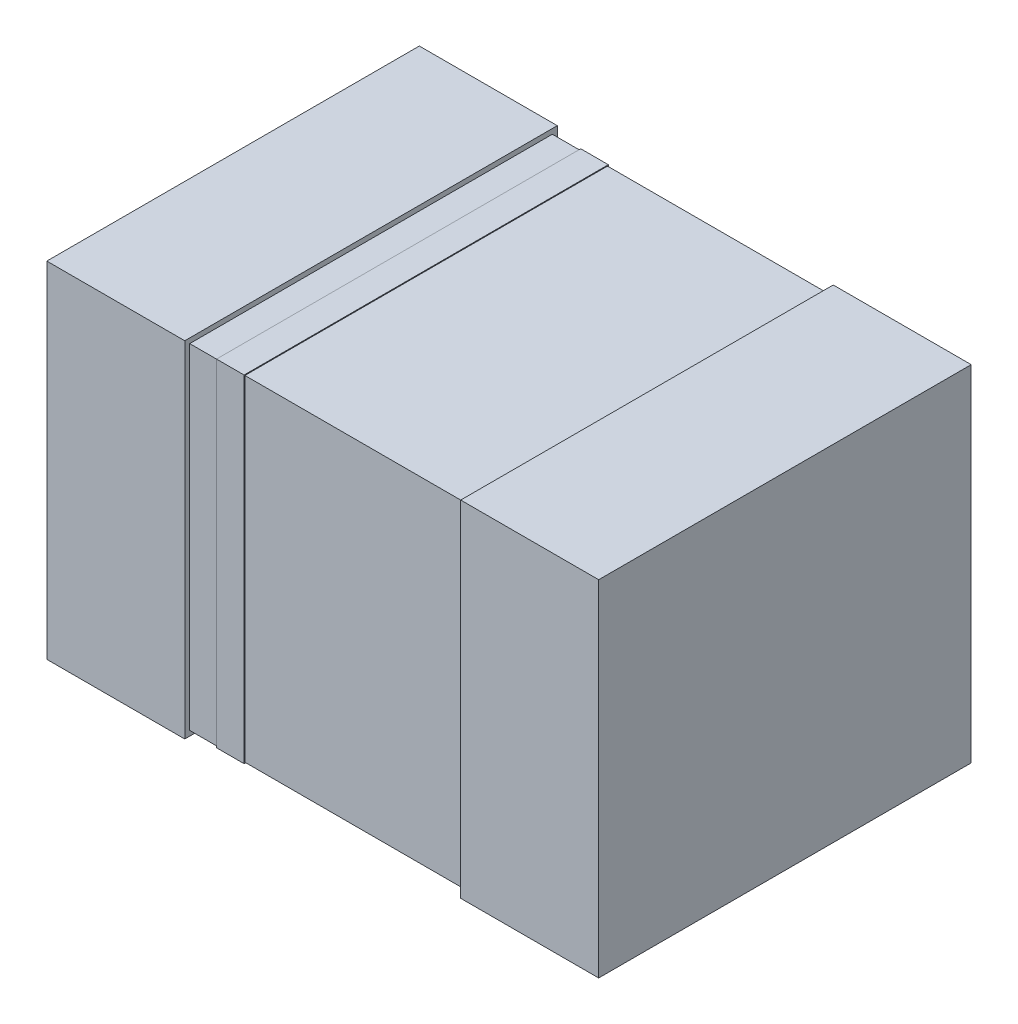
ISO-10303-21;
HEADER;
FILE_DESCRIPTION(('STEP AP214'),'2;1');
FILE_NAME('part.step','',(''),(''),'','','');
FILE_SCHEMA(('AUTOMOTIVE_DESIGN { 1 0 10303 214 1 1 1 1 }'));
ENDSEC;
DATA;
#1=APPLICATION_CONTEXT('core data for automotive mechanical design processes');
#2=APPLICATION_PROTOCOL_DEFINITION('international standard','automotive_design',2000,#1);
#3=PRODUCT_CONTEXT('',#1,'mechanical');
#4=PRODUCT('Part','Part','',(#3));
#5=PRODUCT_RELATED_PRODUCT_CATEGORY('part','',(#4));
#6=PRODUCT_DEFINITION_FORMATION('','',#4);
#7=PRODUCT_DEFINITION_CONTEXT('part definition',#1,'design');
#8=PRODUCT_DEFINITION('design','',#6,#7);
#9=PRODUCT_DEFINITION_SHAPE('','',#8);
#10=(LENGTH_UNIT() NAMED_UNIT(*) SI_UNIT(.MILLI.,.METRE.));
#11=(NAMED_UNIT(*) PLANE_ANGLE_UNIT() SI_UNIT($,.RADIAN.));
#12=(NAMED_UNIT(*) SI_UNIT($,.STERADIAN.) SOLID_ANGLE_UNIT());
#13=UNCERTAINTY_MEASURE_WITH_UNIT(LENGTH_MEASURE(1.E-05),#10,'distance_accuracy_value','');
#14=(GEOMETRIC_REPRESENTATION_CONTEXT(3) GLOBAL_UNCERTAINTY_ASSIGNED_CONTEXT((#13)) GLOBAL_UNIT_ASSIGNED_CONTEXT((#10,
#11,#12)) REPRESENTATION_CONTEXT('',''));
#15=CARTESIAN_POINT('',(0.,0.,0.));
#16=DIRECTION('',(0.,0.,1.));
#17=DIRECTION('',(1.,0.,0.));
#18=AXIS2_PLACEMENT_3D('',#15,#16,#17);
#19=CARTESIAN_POINT('',(-0.5,-0.607,0.018));
#20=DIRECTION('',(0.,-1.,0.));
#21=DIRECTION('',(0.,0.,1.));
#22=AXIS2_PLACEMENT_3D('',#19,#20,#21);
#23=PLANE('',#22);
#24=DIRECTION('',(-1.,0.,0.));
#25=VECTOR('',#24,1.);
#26=CARTESIAN_POINT('',(0.5,-0.607,0.018));
#27=LINE('',#26,#25);
#28=CARTESIAN_POINT('',(0.5,-0.607,0.018));
#29=VERTEX_POINT('',#28);
#30=CARTESIAN_POINT('',(-0.5,-0.607,0.018));
#31=VERTEX_POINT('',#30);
#32=EDGE_CURVE('P0_E11',#29,#31,#27,.T.);
#33=ORIENTED_EDGE('',*,*,#32,.F.);
#34=DIRECTION('',(0.,0.,-1.));
#35=VECTOR('',#34,1.);
#36=CARTESIAN_POINT('',(0.5,-0.607,1.332));
#37=LINE('',#36,#35);
#38=CARTESIAN_POINT('',(0.5,-0.607,1.332));
#39=VERTEX_POINT('',#38);
#40=EDGE_CURVE('P0_E24',#39,#29,#37,.T.);
#41=ORIENTED_EDGE('',*,*,#40,.F.);
#42=DIRECTION('',(1.,0.,0.));
#43=VECTOR('',#42,1.);
#44=CARTESIAN_POINT('',(-0.5,-0.607,1.332));
#45=LINE('',#44,#43);
#46=CARTESIAN_POINT('',(-0.5,-0.607,1.332));
#47=VERTEX_POINT('',#46);
#48=EDGE_CURVE('P0_E88',#47,#39,#45,.T.);
#49=ORIENTED_EDGE('',*,*,#48,.F.);
#50=DIRECTION('',(0.,0.,1.));
#51=VECTOR('',#50,1.);
#52=CARTESIAN_POINT('',(-0.5,-0.607,0.018));
#53=LINE('',#52,#51);
#54=EDGE_CURVE('P0_E77',#31,#47,#53,.T.);
#55=ORIENTED_EDGE('',*,*,#54,.F.);
#56=EDGE_LOOP('',(#33,#41,#49,#55));
#57=FACE_BOUND('',#56,.T.);
#58=ADVANCED_FACE('P0_F17',(#57),#23,.T.);
#59=CARTESIAN_POINT('',(0.5,-0.607,0.018));
#60=DIRECTION('',(1.,0.,0.));
#61=DIRECTION('',(0.,0.,1.));
#62=AXIS2_PLACEMENT_3D('',#59,#60,#61);
#63=PLANE('',#62);
#64=DIRECTION('',(0.,-1.,0.));
#65=VECTOR('',#64,1.);
#66=CARTESIAN_POINT('',(0.5,0.607,0.018));
#67=LINE('',#66,#65);
#68=CARTESIAN_POINT('',(0.5,0.607,0.018));
#69=VERTEX_POINT('',#68);
#70=EDGE_CURVE('P0_E85',#69,#29,#67,.T.);
#71=ORIENTED_EDGE('',*,*,#70,.F.);
#72=DIRECTION('',(0.,0.,-1.));
#73=VECTOR('',#72,1.);
#74=CARTESIAN_POINT('',(0.5,0.607,1.332));
#75=LINE('',#74,#73);
#76=CARTESIAN_POINT('',(0.5,0.607,1.332));
#77=VERTEX_POINT('',#76);
#78=EDGE_CURVE('P0_E83',#77,#69,#75,.T.);
#79=ORIENTED_EDGE('',*,*,#78,.F.);
#80=DIRECTION('',(0.,1.,0.));
#81=VECTOR('',#80,1.);
#82=CARTESIAN_POINT('',(0.5,-0.607,1.332));
#83=LINE('',#82,#81);
#84=EDGE_CURVE('P0_E72',#39,#77,#83,.T.);
#85=ORIENTED_EDGE('',*,*,#84,.F.);
#86=ORIENTED_EDGE('',*,*,#40,.T.);
#87=EDGE_LOOP('',(#71,#79,#85,#86));
#88=FACE_BOUND('',#87,.T.);
#89=ADVANCED_FACE('P0_F90',(#88),#63,.T.);
#90=CARTESIAN_POINT('',(0.5,0.607,0.018));
#91=DIRECTION('',(0.,1.,0.));
#92=DIRECTION('',(0.,0.,1.));
#93=AXIS2_PLACEMENT_3D('',#90,#91,#92);
#94=PLANE('',#93);
#95=DIRECTION('',(1.,0.,0.));
#96=VECTOR('',#95,1.);
#97=CARTESIAN_POINT('',(-0.5,0.607,0.018));
#98=LINE('',#97,#96);
#99=CARTESIAN_POINT('',(-0.5,0.607,0.018));
#100=VERTEX_POINT('',#99);
#101=EDGE_CURVE('P0_E60',#100,#69,#98,.T.);
#102=ORIENTED_EDGE('',*,*,#101,.F.);
#103=DIRECTION('',(0.,0.,-1.));
#104=VECTOR('',#103,1.);
#105=CARTESIAN_POINT('',(-0.5,0.607,1.332));
#106=LINE('',#105,#104);
#107=CARTESIAN_POINT('',(-0.5,0.607,1.332));
#108=VERTEX_POINT('',#107);
#109=EDGE_CURVE('P0_E54',#108,#100,#106,.T.);
#110=ORIENTED_EDGE('',*,*,#109,.F.);
#111=DIRECTION('',(-1.,0.,0.));
#112=VECTOR('',#111,1.);
#113=CARTESIAN_POINT('',(0.5,0.607,1.332));
#114=LINE('',#113,#112);
#115=EDGE_CURVE('P0_E58',#77,#108,#114,.T.);
#116=ORIENTED_EDGE('',*,*,#115,.F.);
#117=ORIENTED_EDGE('',*,*,#78,.T.);
#118=EDGE_LOOP('',(#102,#110,#116,#117));
#119=FACE_BOUND('',#118,.T.);
#120=ADVANCED_FACE('P0_F56',(#119),#94,.T.);
#121=CARTESIAN_POINT('',(-0.5,0.607,0.018));
#122=DIRECTION('',(-1.,0.,0.));
#123=DIRECTION('',(0.,0.,1.));
#124=AXIS2_PLACEMENT_3D('',#121,#122,#123);
#125=PLANE('',#124);
#126=DIRECTION('',(0.,1.,0.));
#127=VECTOR('',#126,1.);
#128=CARTESIAN_POINT('',(-0.5,-0.607,0.018));
#129=LINE('',#128,#127);
#130=EDGE_CURVE('P0_E73',#31,#100,#129,.T.);
#131=ORIENTED_EDGE('',*,*,#130,.F.);
#132=ORIENTED_EDGE('',*,*,#54,.T.);
#133=DIRECTION('',(0.,-1.,0.));
#134=VECTOR('',#133,1.);
#135=CARTESIAN_POINT('',(-0.5,0.607,1.332));
#136=LINE('',#135,#134);
#137=EDGE_CURVE('P0_E70',#108,#47,#136,.T.);
#138=ORIENTED_EDGE('',*,*,#137,.F.);
#139=ORIENTED_EDGE('',*,*,#109,.T.);
#140=EDGE_LOOP('',(#131,#132,#138,#139));
#141=FACE_BOUND('',#140,.T.);
#142=ADVANCED_FACE('P0_F76',(#141),#125,.T.);
#143=CARTESIAN_POINT('',(-0.5,0.607,0.018));
#144=DIRECTION('',(0.,0.,-1.));
#145=DIRECTION('',(0.,1.,0.));
#146=AXIS2_PLACEMENT_3D('',#143,#144,#145);
#147=PLANE('',#146);
#148=ORIENTED_EDGE('',*,*,#101,.T.);
#149=ORIENTED_EDGE('',*,*,#70,.T.);
#150=ORIENTED_EDGE('',*,*,#32,.T.);
#151=ORIENTED_EDGE('',*,*,#130,.T.);
#152=EDGE_LOOP('',(#148,#149,#150,#151));
#153=FACE_BOUND('',#152,.T.);
#154=ADVANCED_FACE('P0_F91',(#153),#147,.T.);
#155=CARTESIAN_POINT('',(-0.5,-0.607,1.332));
#156=DIRECTION('',(0.,0.,1.));
#157=DIRECTION('',(0.,1.,0.));
#158=AXIS2_PLACEMENT_3D('',#155,#156,#157);
#159=PLANE('',#158);
#160=ORIENTED_EDGE('',*,*,#48,.T.);
#161=ORIENTED_EDGE('',*,*,#84,.T.);
#162=ORIENTED_EDGE('',*,*,#115,.T.);
#163=ORIENTED_EDGE('',*,*,#137,.T.);
#164=EDGE_LOOP('',(#160,#161,#162,#163));
#165=FACE_BOUND('',#164,.T.);
#166=ADVANCED_FACE('P0_F69',(#165),#159,.T.);
#167=CLOSED_SHELL('',(#58,#89,#120,#142,#154,#166));
#168=MANIFOLD_SOLID_BREP('P0_B1',#167);
#169=CARTESIAN_POINT('',(0.5,-0.625,0.));
#170=DIRECTION('',(0.,-1.,0.));
#171=DIRECTION('',(0.,0.,1.));
#172=AXIS2_PLACEMENT_3D('',#169,#170,#171);
#173=PLANE('',#172);
#174=DIRECTION('',(-1.,0.,0.));
#175=VECTOR('',#174,1.);
#176=CARTESIAN_POINT('',(1.,-0.625,0.));
#177=LINE('',#176,#175);
#178=CARTESIAN_POINT('',(1.,-0.625,0.));
#179=VERTEX_POINT('',#178);
#180=CARTESIAN_POINT('',(0.5,-0.625,0.));
#181=VERTEX_POINT('',#180);
#182=EDGE_CURVE('P1_E11',#179,#181,#177,.T.);
#183=ORIENTED_EDGE('',*,*,#182,.F.);
#184=DIRECTION('',(0.,0.,-1.));
#185=VECTOR('',#184,1.);
#186=CARTESIAN_POINT('',(1.,-0.625,1.35));
#187=LINE('',#186,#185);
#188=CARTESIAN_POINT('',(1.,-0.625,1.35));
#189=VERTEX_POINT('',#188);
#190=EDGE_CURVE('P1_E24',#189,#179,#187,.T.);
#191=ORIENTED_EDGE('',*,*,#190,.F.);
#192=DIRECTION('',(1.,0.,0.));
#193=VECTOR('',#192,1.);
#194=CARTESIAN_POINT('',(0.5,-0.625,1.35));
#195=LINE('',#194,#193);
#196=CARTESIAN_POINT('',(0.5,-0.625,1.35));
#197=VERTEX_POINT('',#196);
#198=EDGE_CURVE('P1_E88',#197,#189,#195,.T.);
#199=ORIENTED_EDGE('',*,*,#198,.F.);
#200=DIRECTION('',(0.,0.,1.));
#201=VECTOR('',#200,1.);
#202=CARTESIAN_POINT('',(0.5,-0.625,0.));
#203=LINE('',#202,#201);
#204=EDGE_CURVE('P1_E77',#181,#197,#203,.T.);
#205=ORIENTED_EDGE('',*,*,#204,.F.);
#206=EDGE_LOOP('',(#183,#191,#199,#205));
#207=FACE_BOUND('',#206,.T.);
#208=ADVANCED_FACE('P1_F17',(#207),#173,.T.);
#209=CARTESIAN_POINT('',(1.,-0.625,0.));
#210=DIRECTION('',(1.,0.,0.));
#211=DIRECTION('',(0.,0.,1.));
#212=AXIS2_PLACEMENT_3D('',#209,#210,#211);
#213=PLANE('',#212);
#214=DIRECTION('',(0.,-1.,0.));
#215=VECTOR('',#214,1.);
#216=CARTESIAN_POINT('',(1.,0.625,0.));
#217=LINE('',#216,#215);
#218=CARTESIAN_POINT('',(1.,0.625,0.));
#219=VERTEX_POINT('',#218);
#220=EDGE_CURVE('P1_E85',#219,#179,#217,.T.);
#221=ORIENTED_EDGE('',*,*,#220,.F.);
#222=DIRECTION('',(0.,0.,-1.));
#223=VECTOR('',#222,1.);
#224=CARTESIAN_POINT('',(1.,0.625,1.35));
#225=LINE('',#224,#223);
#226=CARTESIAN_POINT('',(1.,0.625,1.35));
#227=VERTEX_POINT('',#226);
#228=EDGE_CURVE('P1_E83',#227,#219,#225,.T.);
#229=ORIENTED_EDGE('',*,*,#228,.F.);
#230=DIRECTION('',(0.,1.,0.));
#231=VECTOR('',#230,1.);
#232=CARTESIAN_POINT('',(1.,-0.625,1.35));
#233=LINE('',#232,#231);
#234=EDGE_CURVE('P1_E72',#189,#227,#233,.T.);
#235=ORIENTED_EDGE('',*,*,#234,.F.);
#236=ORIENTED_EDGE('',*,*,#190,.T.);
#237=EDGE_LOOP('',(#221,#229,#235,#236));
#238=FACE_BOUND('',#237,.T.);
#239=ADVANCED_FACE('P1_F90',(#238),#213,.T.);
#240=CARTESIAN_POINT('',(1.,0.625,0.));
#241=DIRECTION('',(0.,1.,0.));
#242=DIRECTION('',(0.,0.,1.));
#243=AXIS2_PLACEMENT_3D('',#240,#241,#242);
#244=PLANE('',#243);
#245=DIRECTION('',(1.,0.,0.));
#246=VECTOR('',#245,1.);
#247=CARTESIAN_POINT('',(0.5,0.625,0.));
#248=LINE('',#247,#246);
#249=CARTESIAN_POINT('',(0.5,0.625,0.));
#250=VERTEX_POINT('',#249);
#251=EDGE_CURVE('P1_E60',#250,#219,#248,.T.);
#252=ORIENTED_EDGE('',*,*,#251,.F.);
#253=DIRECTION('',(0.,0.,-1.));
#254=VECTOR('',#253,1.);
#255=CARTESIAN_POINT('',(0.5,0.625,1.35));
#256=LINE('',#255,#254);
#257=CARTESIAN_POINT('',(0.5,0.625,1.35));
#258=VERTEX_POINT('',#257);
#259=EDGE_CURVE('P1_E54',#258,#250,#256,.T.);
#260=ORIENTED_EDGE('',*,*,#259,.F.);
#261=DIRECTION('',(-1.,0.,0.));
#262=VECTOR('',#261,1.);
#263=CARTESIAN_POINT('',(1.,0.625,1.35));
#264=LINE('',#263,#262);
#265=EDGE_CURVE('P1_E58',#227,#258,#264,.T.);
#266=ORIENTED_EDGE('',*,*,#265,.F.);
#267=ORIENTED_EDGE('',*,*,#228,.T.);
#268=EDGE_LOOP('',(#252,#260,#266,#267));
#269=FACE_BOUND('',#268,.T.);
#270=ADVANCED_FACE('P1_F56',(#269),#244,.T.);
#271=CARTESIAN_POINT('',(0.5,0.625,0.));
#272=DIRECTION('',(-1.,0.,0.));
#273=DIRECTION('',(0.,0.,1.));
#274=AXIS2_PLACEMENT_3D('',#271,#272,#273);
#275=PLANE('',#274);
#276=DIRECTION('',(0.,1.,0.));
#277=VECTOR('',#276,1.);
#278=CARTESIAN_POINT('',(0.5,-0.625,0.));
#279=LINE('',#278,#277);
#280=EDGE_CURVE('P1_E73',#181,#250,#279,.T.);
#281=ORIENTED_EDGE('',*,*,#280,.F.);
#282=ORIENTED_EDGE('',*,*,#204,.T.);
#283=DIRECTION('',(0.,-1.,0.));
#284=VECTOR('',#283,1.);
#285=CARTESIAN_POINT('',(0.5,0.625,1.35));
#286=LINE('',#285,#284);
#287=EDGE_CURVE('P1_E70',#258,#197,#286,.T.);
#288=ORIENTED_EDGE('',*,*,#287,.F.);
#289=ORIENTED_EDGE('',*,*,#259,.T.);
#290=EDGE_LOOP('',(#281,#282,#288,#289));
#291=FACE_BOUND('',#290,.T.);
#292=ADVANCED_FACE('P1_F76',(#291),#275,.T.);
#293=CARTESIAN_POINT('',(0.5,0.625,0.));
#294=DIRECTION('',(0.,0.,-1.));
#295=DIRECTION('',(0.,1.,0.));
#296=AXIS2_PLACEMENT_3D('',#293,#294,#295);
#297=PLANE('',#296);
#298=ORIENTED_EDGE('',*,*,#251,.T.);
#299=ORIENTED_EDGE('',*,*,#220,.T.);
#300=ORIENTED_EDGE('',*,*,#182,.T.);
#301=ORIENTED_EDGE('',*,*,#280,.T.);
#302=EDGE_LOOP('',(#298,#299,#300,#301));
#303=FACE_BOUND('',#302,.T.);
#304=ADVANCED_FACE('P1_F91',(#303),#297,.T.);
#305=CARTESIAN_POINT('',(0.5,-0.625,1.35));
#306=DIRECTION('',(0.,0.,1.));
#307=DIRECTION('',(0.,1.,0.));
#308=AXIS2_PLACEMENT_3D('',#305,#306,#307);
#309=PLANE('',#308);
#310=ORIENTED_EDGE('',*,*,#198,.T.);
#311=ORIENTED_EDGE('',*,*,#234,.T.);
#312=ORIENTED_EDGE('',*,*,#265,.T.);
#313=ORIENTED_EDGE('',*,*,#287,.T.);
#314=EDGE_LOOP('',(#310,#311,#312,#313));
#315=FACE_BOUND('',#314,.T.);
#316=ADVANCED_FACE('P1_F69',(#315),#309,.T.);
#317=CLOSED_SHELL('',(#208,#239,#270,#292,#304,#316));
#318=MANIFOLD_SOLID_BREP('P1_B1',#317);
#319=CARTESIAN_POINT('',(-1.,-0.625,0.));
#320=DIRECTION('',(0.,-1.,0.));
#321=DIRECTION('',(0.,0.,1.));
#322=AXIS2_PLACEMENT_3D('',#319,#320,#321);
#323=PLANE('',#322);
#324=DIRECTION('',(-1.,0.,0.));
#325=VECTOR('',#324,1.);
#326=CARTESIAN_POINT('',(-0.5,-0.625,0.));
#327=LINE('',#326,#325);
#328=CARTESIAN_POINT('',(-0.5,-0.625,0.));
#329=VERTEX_POINT('',#328);
#330=CARTESIAN_POINT('',(-1.,-0.625,0.));
#331=VERTEX_POINT('',#330);
#332=EDGE_CURVE('P2_E11',#329,#331,#327,.T.);
#333=ORIENTED_EDGE('',*,*,#332,.F.);
#334=DIRECTION('',(0.,0.,-1.));
#335=VECTOR('',#334,1.);
#336=CARTESIAN_POINT('',(-0.5,-0.625,1.35));
#337=LINE('',#336,#335);
#338=CARTESIAN_POINT('',(-0.5,-0.625,1.35));
#339=VERTEX_POINT('',#338);
#340=EDGE_CURVE('P2_E24',#339,#329,#337,.T.);
#341=ORIENTED_EDGE('',*,*,#340,.F.);
#342=DIRECTION('',(1.,0.,0.));
#343=VECTOR('',#342,1.);
#344=CARTESIAN_POINT('',(-1.,-0.625,1.35));
#345=LINE('',#344,#343);
#346=CARTESIAN_POINT('',(-1.,-0.625,1.35));
#347=VERTEX_POINT('',#346);
#348=EDGE_CURVE('P2_E88',#347,#339,#345,.T.);
#349=ORIENTED_EDGE('',*,*,#348,.F.);
#350=DIRECTION('',(0.,0.,1.));
#351=VECTOR('',#350,1.);
#352=CARTESIAN_POINT('',(-1.,-0.625,0.));
#353=LINE('',#352,#351);
#354=EDGE_CURVE('P2_E77',#331,#347,#353,.T.);
#355=ORIENTED_EDGE('',*,*,#354,.F.);
#356=EDGE_LOOP('',(#333,#341,#349,#355));
#357=FACE_BOUND('',#356,.T.);
#358=ADVANCED_FACE('P2_F17',(#357),#323,.T.);
#359=CARTESIAN_POINT('',(-0.5,-0.625,0.));
#360=DIRECTION('',(1.,0.,0.));
#361=DIRECTION('',(0.,0.,1.));
#362=AXIS2_PLACEMENT_3D('',#359,#360,#361);
#363=PLANE('',#362);
#364=DIRECTION('',(0.,-1.,0.));
#365=VECTOR('',#364,1.);
#366=CARTESIAN_POINT('',(-0.5,0.625,0.));
#367=LINE('',#366,#365);
#368=CARTESIAN_POINT('',(-0.5,0.625,0.));
#369=VERTEX_POINT('',#368);
#370=EDGE_CURVE('P2_E85',#369,#329,#367,.T.);
#371=ORIENTED_EDGE('',*,*,#370,.F.);
#372=DIRECTION('',(0.,0.,-1.));
#373=VECTOR('',#372,1.);
#374=CARTESIAN_POINT('',(-0.5,0.625,1.35));
#375=LINE('',#374,#373);
#376=CARTESIAN_POINT('',(-0.5,0.625,1.35));
#377=VERTEX_POINT('',#376);
#378=EDGE_CURVE('P2_E83',#377,#369,#375,.T.);
#379=ORIENTED_EDGE('',*,*,#378,.F.);
#380=DIRECTION('',(0.,1.,0.));
#381=VECTOR('',#380,1.);
#382=CARTESIAN_POINT('',(-0.5,-0.625,1.35));
#383=LINE('',#382,#381);
#384=EDGE_CURVE('P2_E72',#339,#377,#383,.T.);
#385=ORIENTED_EDGE('',*,*,#384,.F.);
#386=ORIENTED_EDGE('',*,*,#340,.T.);
#387=EDGE_LOOP('',(#371,#379,#385,#386));
#388=FACE_BOUND('',#387,.T.);
#389=ADVANCED_FACE('P2_F90',(#388),#363,.T.);
#390=CARTESIAN_POINT('',(-0.5,0.625,0.));
#391=DIRECTION('',(0.,1.,0.));
#392=DIRECTION('',(0.,0.,1.));
#393=AXIS2_PLACEMENT_3D('',#390,#391,#392);
#394=PLANE('',#393);
#395=DIRECTION('',(1.,0.,0.));
#396=VECTOR('',#395,1.);
#397=CARTESIAN_POINT('',(-1.,0.625,0.));
#398=LINE('',#397,#396);
#399=CARTESIAN_POINT('',(-1.,0.625,0.));
#400=VERTEX_POINT('',#399);
#401=EDGE_CURVE('P2_E60',#400,#369,#398,.T.);
#402=ORIENTED_EDGE('',*,*,#401,.F.);
#403=DIRECTION('',(0.,0.,-1.));
#404=VECTOR('',#403,1.);
#405=CARTESIAN_POINT('',(-1.,0.625,1.35));
#406=LINE('',#405,#404);
#407=CARTESIAN_POINT('',(-1.,0.625,1.35));
#408=VERTEX_POINT('',#407);
#409=EDGE_CURVE('P2_E54',#408,#400,#406,.T.);
#410=ORIENTED_EDGE('',*,*,#409,.F.);
#411=DIRECTION('',(-1.,0.,0.));
#412=VECTOR('',#411,1.);
#413=CARTESIAN_POINT('',(-0.5,0.625,1.35));
#414=LINE('',#413,#412);
#415=EDGE_CURVE('P2_E58',#377,#408,#414,.T.);
#416=ORIENTED_EDGE('',*,*,#415,.F.);
#417=ORIENTED_EDGE('',*,*,#378,.T.);
#418=EDGE_LOOP('',(#402,#410,#416,#417));
#419=FACE_BOUND('',#418,.T.);
#420=ADVANCED_FACE('P2_F56',(#419),#394,.T.);
#421=CARTESIAN_POINT('',(-1.,0.625,0.));
#422=DIRECTION('',(-1.,0.,0.));
#423=DIRECTION('',(0.,0.,1.));
#424=AXIS2_PLACEMENT_3D('',#421,#422,#423);
#425=PLANE('',#424);
#426=DIRECTION('',(0.,1.,0.));
#427=VECTOR('',#426,1.);
#428=CARTESIAN_POINT('',(-1.,-0.625,0.));
#429=LINE('',#428,#427);
#430=EDGE_CURVE('P2_E73',#331,#400,#429,.T.);
#431=ORIENTED_EDGE('',*,*,#430,.F.);
#432=ORIENTED_EDGE('',*,*,#354,.T.);
#433=DIRECTION('',(0.,-1.,0.));
#434=VECTOR('',#433,1.);
#435=CARTESIAN_POINT('',(-1.,0.625,1.35));
#436=LINE('',#435,#434);
#437=EDGE_CURVE('P2_E70',#408,#347,#436,.T.);
#438=ORIENTED_EDGE('',*,*,#437,.F.);
#439=ORIENTED_EDGE('',*,*,#409,.T.);
#440=EDGE_LOOP('',(#431,#432,#438,#439));
#441=FACE_BOUND('',#440,.T.);
#442=ADVANCED_FACE('P2_F76',(#441),#425,.T.);
#443=CARTESIAN_POINT('',(-1.,0.625,0.));
#444=DIRECTION('',(0.,0.,-1.));
#445=DIRECTION('',(0.,1.,0.));
#446=AXIS2_PLACEMENT_3D('',#443,#444,#445);
#447=PLANE('',#446);
#448=ORIENTED_EDGE('',*,*,#401,.T.);
#449=ORIENTED_EDGE('',*,*,#370,.T.);
#450=ORIENTED_EDGE('',*,*,#332,.T.);
#451=ORIENTED_EDGE('',*,*,#430,.T.);
#452=EDGE_LOOP('',(#448,#449,#450,#451));
#453=FACE_BOUND('',#452,.T.);
#454=ADVANCED_FACE('P2_F91',(#453),#447,.T.);
#455=CARTESIAN_POINT('',(-1.,-0.625,1.35));
#456=DIRECTION('',(0.,0.,1.));
#457=DIRECTION('',(0.,1.,0.));
#458=AXIS2_PLACEMENT_3D('',#455,#456,#457);
#459=PLANE('',#458);
#460=ORIENTED_EDGE('',*,*,#348,.T.);
#461=ORIENTED_EDGE('',*,*,#384,.T.);
#462=ORIENTED_EDGE('',*,*,#415,.T.);
#463=ORIENTED_EDGE('',*,*,#437,.T.);
#464=EDGE_LOOP('',(#460,#461,#462,#463));
#465=FACE_BOUND('',#464,.T.);
#466=ADVANCED_FACE('P2_F69',(#465),#459,.T.);
#467=CLOSED_SHELL('',(#358,#389,#420,#442,#454,#466));
#468=MANIFOLD_SOLID_BREP('P2_B1',#467);
#469=CARTESIAN_POINT('',(-0.4,0.61,0.015));
#470=DIRECTION('',(0.,0.,-1.));
#471=DIRECTION('',(0.,1.,0.));
#472=AXIS2_PLACEMENT_3D('',#469,#470,#471);
#473=PLANE('',#472);
#474=DIRECTION('',(-1.,0.,0.));
#475=VECTOR('',#474,1.);
#476=CARTESIAN_POINT('',(-0.3,0.61,0.015));
#477=LINE('',#476,#475);
#478=CARTESIAN_POINT('',(-0.3,0.61,0.015));
#479=VERTEX_POINT('',#478);
#480=CARTESIAN_POINT('',(-0.4,0.61,0.015));
#481=VERTEX_POINT('',#480);
#482=EDGE_CURVE('P3_E10',#479,#481,#477,.T.);
#483=ORIENTED_EDGE('',*,*,#482,.F.);
#484=DIRECTION('',(0.,1.,0.));
#485=VECTOR('',#484,1.);
#486=CARTESIAN_POINT('',(-0.3,-0.61,0.015));
#487=LINE('',#486,#485);
#488=CARTESIAN_POINT('',(-0.3,-0.61,0.015));
#489=VERTEX_POINT('',#488);
#490=EDGE_CURVE('P3_E23',#489,#479,#487,.T.);
#491=ORIENTED_EDGE('',*,*,#490,.F.);
#492=DIRECTION('',(1.,0.,0.));
#493=VECTOR('',#492,1.);
#494=CARTESIAN_POINT('',(-0.4,-0.61,0.015));
#495=LINE('',#494,#493);
#496=CARTESIAN_POINT('',(-0.4,-0.61,0.015));
#497=VERTEX_POINT('',#496);
#498=EDGE_CURVE('P3_E160',#497,#489,#495,.T.);
#499=ORIENTED_EDGE('',*,*,#498,.F.);
#500=DIRECTION('',(0.,-1.,0.));
#501=VECTOR('',#500,1.);
#502=CARTESIAN_POINT('',(-0.4,0.61,0.015));
#503=LINE('',#502,#501);
#504=EDGE_CURVE('P3_E157',#481,#497,#503,.T.);
#505=ORIENTED_EDGE('',*,*,#504,.F.);
#506=EDGE_LOOP('',(#483,#491,#499,#505));
#507=FACE_BOUND('',#506,.T.);
#508=ADVANCED_FACE('P3_F16',(#507),#473,.T.);
#509=CARTESIAN_POINT('',(-0.4,-0.61,0.015));
#510=DIRECTION('',(0.,-1.,0.));
#511=DIRECTION('',(0.,0.,1.));
#512=AXIS2_PLACEMENT_3D('',#509,#510,#511);
#513=PLANE('',#512);
#514=ORIENTED_EDGE('',*,*,#498,.T.);
#515=DIRECTION('',(0.,0.,-1.));
#516=VECTOR('',#515,1.);
#517=CARTESIAN_POINT('',(-0.3,-0.61,1.335));
#518=LINE('',#517,#516);
#519=CARTESIAN_POINT('',(-0.3,-0.61,1.335));
#520=VERTEX_POINT('',#519);
#521=EDGE_CURVE('P3_E154',#520,#489,#518,.T.);
#522=ORIENTED_EDGE('',*,*,#521,.F.);
#523=DIRECTION('',(1.,0.,0.));
#524=VECTOR('',#523,1.);
#525=CARTESIAN_POINT('',(-0.4,-0.61,1.335));
#526=LINE('',#525,#524);
#527=CARTESIAN_POINT('',(-0.4,-0.61,1.335));
#528=VERTEX_POINT('',#527);
#529=EDGE_CURVE('P3_E151',#528,#520,#526,.T.);
#530=ORIENTED_EDGE('',*,*,#529,.F.);
#531=DIRECTION('',(0.,0.,1.));
#532=VECTOR('',#531,1.);
#533=CARTESIAN_POINT('',(-0.4,-0.61,0.015));
#534=LINE('',#533,#532);
#535=EDGE_CURVE('P3_E148',#497,#528,#534,.T.);
#536=ORIENTED_EDGE('',*,*,#535,.F.);
#537=EDGE_LOOP('',(#514,#522,#530,#536));
#538=FACE_BOUND('',#537,.T.);
#539=ADVANCED_FACE('P3_F172',(#538),#513,.T.);
#540=CARTESIAN_POINT('',(-0.3,0.61,0.015));
#541=DIRECTION('',(0.,1.,0.));
#542=DIRECTION('',(0.,0.,1.));
#543=AXIS2_PLACEMENT_3D('',#540,#541,#542);
#544=PLANE('',#543);
#545=ORIENTED_EDGE('',*,*,#482,.T.);
#546=DIRECTION('',(0.,0.,-1.));
#547=VECTOR('',#546,1.);
#548=CARTESIAN_POINT('',(-0.4,0.61,1.335));
#549=LINE('',#548,#547);
#550=CARTESIAN_POINT('',(-0.4,0.61,1.335));
#551=VERTEX_POINT('',#550);
#552=EDGE_CURVE('P3_E145',#551,#481,#549,.T.);
#553=ORIENTED_EDGE('',*,*,#552,.F.);
#554=DIRECTION('',(-1.,0.,0.));
#555=VECTOR('',#554,1.);
#556=CARTESIAN_POINT('',(-0.3,0.61,1.335));
#557=LINE('',#556,#555);
#558=CARTESIAN_POINT('',(-0.3,0.61,1.335));
#559=VERTEX_POINT('',#558);
#560=EDGE_CURVE('P3_E142',#559,#551,#557,.T.);
#561=ORIENTED_EDGE('',*,*,#560,.F.);
#562=DIRECTION('',(0.,0.,1.));
#563=VECTOR('',#562,1.);
#564=CARTESIAN_POINT('',(-0.3,0.61,0.015));
#565=LINE('',#564,#563);
#566=EDGE_CURVE('P3_E139',#479,#559,#565,.T.);
#567=ORIENTED_EDGE('',*,*,#566,.F.);
#568=EDGE_LOOP('',(#545,#553,#561,#567));
#569=FACE_BOUND('',#568,.T.);
#570=ADVANCED_FACE('P3_F166',(#569),#544,.T.);
#571=CARTESIAN_POINT('',(-0.4,-0.61,1.335));
#572=DIRECTION('',(0.,0.,1.));
#573=DIRECTION('',(0.,1.,0.));
#574=AXIS2_PLACEMENT_3D('',#571,#572,#573);
#575=PLANE('',#574);
#576=ORIENTED_EDGE('',*,*,#529,.T.);
#577=DIRECTION('',(0.,-1.,0.));
#578=VECTOR('',#577,1.);
#579=CARTESIAN_POINT('',(-0.3,0.61,1.335));
#580=LINE('',#579,#578);
#581=EDGE_CURVE('P3_E136',#559,#520,#580,.T.);
#582=ORIENTED_EDGE('',*,*,#581,.F.);
#583=ORIENTED_EDGE('',*,*,#560,.T.);
#584=DIRECTION('',(0.,1.,0.));
#585=VECTOR('',#584,1.);
#586=CARTESIAN_POINT('',(-0.4,-0.61,1.335));
#587=LINE('',#586,#585);
#588=EDGE_CURVE('P3_E134',#528,#551,#587,.T.);
#589=ORIENTED_EDGE('',*,*,#588,.F.);
#590=EDGE_LOOP('',(#576,#582,#583,#589));
#591=FACE_BOUND('',#590,.T.);
#592=ADVANCED_FACE('P3_F169',(#591),#575,.T.);
#593=CARTESIAN_POINT('',(-0.3,-0.61,0.015));
#594=DIRECTION('',(1.,0.,0.));
#595=DIRECTION('',(0.,0.,1.));
#596=AXIS2_PLACEMENT_3D('',#593,#594,#595);
#597=PLANE('',#596);
#598=ORIENTED_EDGE('',*,*,#490,.T.);
#599=ORIENTED_EDGE('',*,*,#566,.T.);
#600=DIRECTION('',(0.,0.707106781186548,0.707106781186548));
#601=VECTOR('',#600,1.);
#602=CARTESIAN_POINT('',(-0.3,0.607,1.332));
#603=LINE('',#602,#601);
#604=CARTESIAN_POINT('',(-0.3,0.607,1.332));
#605=VERTEX_POINT('',#604);
#606=EDGE_CURVE('P3_E131',#605,#559,#603,.T.);
#607=ORIENTED_EDGE('',*,*,#606,.F.);
#608=DIRECTION('',(0.,0.,1.));
#609=VECTOR('',#608,1.);
#610=CARTESIAN_POINT('',(-0.3,0.607,0.018));
#611=LINE('',#610,#609);
#612=CARTESIAN_POINT('',(-0.3,0.607,0.018));
#613=VERTEX_POINT('',#612);
#614=EDGE_CURVE('P3_E128',#613,#605,#611,.T.);
#615=ORIENTED_EDGE('',*,*,#614,.F.);
#616=DIRECTION('',(0.,1.,0.));
#617=VECTOR('',#616,1.);
#618=CARTESIAN_POINT('',(-0.3,-0.607,0.018));
#619=LINE('',#618,#617);
#620=CARTESIAN_POINT('',(-0.3,-0.607,0.018));
#621=VERTEX_POINT('',#620);
#622=EDGE_CURVE('P3_E126',#621,#613,#619,.T.);
#623=ORIENTED_EDGE('',*,*,#622,.F.);
#624=DIRECTION('',(0.,0.707106781186548,0.707106781186548));
#625=VECTOR('',#624,1.);
#626=CARTESIAN_POINT('',(-0.3,-0.61,0.015));
#627=LINE('',#626,#625);
#628=EDGE_CURVE('P3_E123',#489,#621,#627,.T.);
#629=ORIENTED_EDGE('',*,*,#628,.F.);
#630=EDGE_LOOP('',(#598,#599,#607,#615,#623,#629));
#631=FACE_BOUND('',#630,.T.);
#632=ADVANCED_FACE('P3_F163',(#631),#597,.T.);
#633=CARTESIAN_POINT('',(-0.3,-0.61,0.015));
#634=DIRECTION('',(1.,0.,0.));
#635=DIRECTION('',(0.,0.,1.));
#636=AXIS2_PLACEMENT_3D('',#633,#634,#635);
#637=PLANE('',#636);
#638=ORIENTED_EDGE('',*,*,#628,.T.);
#639=DIRECTION('',(0.,0.,-1.));
#640=VECTOR('',#639,1.);
#641=CARTESIAN_POINT('',(-0.3,-0.607,1.332));
#642=LINE('',#641,#640);
#643=CARTESIAN_POINT('',(-0.3,-0.607,1.332));
#644=VERTEX_POINT('',#643);
#645=EDGE_CURVE('P3_E121',#644,#621,#642,.T.);
#646=ORIENTED_EDGE('',*,*,#645,.F.);
#647=DIRECTION('',(0.,-1.,0.));
#648=VECTOR('',#647,1.);
#649=CARTESIAN_POINT('',(-0.3,0.607,1.332));
#650=LINE('',#649,#648);
#651=EDGE_CURVE('P3_E103',#605,#644,#650,.T.);
#652=ORIENTED_EDGE('',*,*,#651,.F.);
#653=ORIENTED_EDGE('',*,*,#606,.T.);
#654=ORIENTED_EDGE('',*,*,#581,.T.);
#655=ORIENTED_EDGE('',*,*,#521,.T.);
#656=EDGE_LOOP('',(#638,#646,#652,#653,#654,#655));
#657=FACE_BOUND('',#656,.T.);
#658=ADVANCED_FACE('P3_F174',(#657),#637,.T.);
#659=CARTESIAN_POINT('',(-0.4,0.61,0.015));
#660=DIRECTION('',(-1.,0.,0.));
#661=DIRECTION('',(0.,0.,1.));
#662=AXIS2_PLACEMENT_3D('',#659,#660,#661);
#663=PLANE('',#662);
#664=ORIENTED_EDGE('',*,*,#504,.T.);
#665=DIRECTION('',(0.,-0.707106781186548,-0.707106781186548));
#666=VECTOR('',#665,1.);
#667=CARTESIAN_POINT('',(-0.4,-0.607,0.018));
#668=LINE('',#667,#666);
#669=CARTESIAN_POINT('',(-0.4,-0.607,0.018));
#670=VERTEX_POINT('',#669);
#671=EDGE_CURVE('P3_E118',#670,#497,#668,.T.);
#672=ORIENTED_EDGE('',*,*,#671,.F.);
#673=DIRECTION('',(0.,-1.,0.));
#674=VECTOR('',#673,1.);
#675=CARTESIAN_POINT('',(-0.4,0.607,0.018));
#676=LINE('',#675,#674);
#677=CARTESIAN_POINT('',(-0.4,0.607,0.018));
#678=VERTEX_POINT('',#677);
#679=EDGE_CURVE('P3_E115',#678,#670,#676,.T.);
#680=ORIENTED_EDGE('',*,*,#679,.F.);
#681=DIRECTION('',(0.,0.,-1.));
#682=VECTOR('',#681,1.);
#683=CARTESIAN_POINT('',(-0.4,0.607,1.332));
#684=LINE('',#683,#682);
#685=CARTESIAN_POINT('',(-0.4,0.607,1.332));
#686=VERTEX_POINT('',#685);
#687=EDGE_CURVE('P3_E112',#686,#678,#684,.T.);
#688=ORIENTED_EDGE('',*,*,#687,.F.);
#689=DIRECTION('',(0.,-0.707106781186548,-0.707106781186548));
#690=VECTOR('',#689,1.);
#691=CARTESIAN_POINT('',(-0.4,0.61,1.335));
#692=LINE('',#691,#690);
#693=EDGE_CURVE('P3_E86',#551,#686,#692,.T.);
#694=ORIENTED_EDGE('',*,*,#693,.F.);
#695=ORIENTED_EDGE('',*,*,#552,.T.);
#696=EDGE_LOOP('',(#664,#672,#680,#688,#694,#695));
#697=FACE_BOUND('',#696,.T.);
#698=ADVANCED_FACE('P3_F182',(#697),#663,.T.);
#699=CARTESIAN_POINT('',(-0.4,-0.607,0.018));
#700=DIRECTION('',(-1.,0.,0.));
#701=DIRECTION('',(0.,0.,1.));
#702=AXIS2_PLACEMENT_3D('',#699,#700,#701);
#703=PLANE('',#702);
#704=ORIENTED_EDGE('',*,*,#671,.T.);
#705=ORIENTED_EDGE('',*,*,#535,.T.);
#706=ORIENTED_EDGE('',*,*,#588,.T.);
#707=ORIENTED_EDGE('',*,*,#693,.T.);
#708=DIRECTION('',(0.,1.,0.));
#709=VECTOR('',#708,1.);
#710=CARTESIAN_POINT('',(-0.4,-0.607,1.332));
#711=LINE('',#710,#709);
#712=CARTESIAN_POINT('',(-0.4,-0.607,1.332));
#713=VERTEX_POINT('',#712);
#714=EDGE_CURVE('P3_E79',#713,#686,#711,.T.);
#715=ORIENTED_EDGE('',*,*,#714,.F.);
#716=DIRECTION('',(0.,0.,1.));
#717=VECTOR('',#716,1.);
#718=CARTESIAN_POINT('',(-0.4,-0.607,0.018));
#719=LINE('',#718,#717);
#720=EDGE_CURVE('P3_E83',#670,#713,#719,.T.);
#721=ORIENTED_EDGE('',*,*,#720,.F.);
#722=EDGE_LOOP('',(#704,#705,#706,#707,#715,#721));
#723=FACE_BOUND('',#722,.T.);
#724=ADVANCED_FACE('P3_F82',(#723),#703,.T.);
#725=CARTESIAN_POINT('',(-0.4,0.607,0.018));
#726=DIRECTION('',(0.,-1.,0.));
#727=DIRECTION('',(0.,0.,1.));
#728=AXIS2_PLACEMENT_3D('',#725,#726,#727);
#729=PLANE('',#728);
#730=DIRECTION('',(-1.,0.,0.));
#731=VECTOR('',#730,1.);
#732=CARTESIAN_POINT('',(-0.3,0.607,0.018));
#733=LINE('',#732,#731);
#734=EDGE_CURVE('P3_E99',#613,#678,#733,.T.);
#735=ORIENTED_EDGE('',*,*,#734,.F.);
#736=ORIENTED_EDGE('',*,*,#614,.T.);
#737=DIRECTION('',(1.,0.,0.));
#738=VECTOR('',#737,1.);
#739=CARTESIAN_POINT('',(-0.4,0.607,1.332));
#740=LINE('',#739,#738);
#741=EDGE_CURVE('P3_E105',#686,#605,#740,.T.);
#742=ORIENTED_EDGE('',*,*,#741,.F.);
#743=ORIENTED_EDGE('',*,*,#687,.T.);
#744=EDGE_LOOP('',(#735,#736,#742,#743));
#745=FACE_BOUND('',#744,.T.);
#746=ADVANCED_FACE('P3_F178',(#745),#729,.T.);
#747=CARTESIAN_POINT('',(-0.3,-0.607,0.018));
#748=DIRECTION('',(0.,1.,0.));
#749=DIRECTION('',(0.,0.,1.));
#750=AXIS2_PLACEMENT_3D('',#747,#748,#749);
#751=PLANE('',#750);
#752=DIRECTION('',(1.,0.,0.));
#753=VECTOR('',#752,1.);
#754=CARTESIAN_POINT('',(-0.4,-0.607,0.018));
#755=LINE('',#754,#753);
#756=EDGE_CURVE('P3_E98',#670,#621,#755,.T.);
#757=ORIENTED_EDGE('',*,*,#756,.F.);
#758=ORIENTED_EDGE('',*,*,#720,.T.);
#759=DIRECTION('',(-1.,0.,0.));
#760=VECTOR('',#759,1.);
#761=CARTESIAN_POINT('',(-0.3,-0.607,1.332));
#762=LINE('',#761,#760);
#763=EDGE_CURVE('P3_E96',#644,#713,#762,.T.);
#764=ORIENTED_EDGE('',*,*,#763,.F.);
#765=ORIENTED_EDGE('',*,*,#645,.T.);
#766=EDGE_LOOP('',(#757,#758,#764,#765));
#767=FACE_BOUND('',#766,.T.);
#768=ADVANCED_FACE('P3_F94',(#767),#751,.T.);
#769=CARTESIAN_POINT('',(-0.4,-0.607,0.018));
#770=DIRECTION('',(0.,0.,1.));
#771=DIRECTION('',(0.,1.,0.));
#772=AXIS2_PLACEMENT_3D('',#769,#770,#771);
#773=PLANE('',#772);
#774=ORIENTED_EDGE('',*,*,#756,.T.);
#775=ORIENTED_EDGE('',*,*,#622,.T.);
#776=ORIENTED_EDGE('',*,*,#734,.T.);
#777=ORIENTED_EDGE('',*,*,#679,.T.);
#778=EDGE_LOOP('',(#774,#775,#776,#777));
#779=FACE_BOUND('',#778,.T.);
#780=ADVANCED_FACE('P3_F180',(#779),#773,.T.);
#781=CARTESIAN_POINT('',(-0.3,-0.607,1.332));
#782=DIRECTION('',(0.,0.,-1.));
#783=DIRECTION('',(0.,1.,0.));
#784=AXIS2_PLACEMENT_3D('',#781,#782,#783);
#785=PLANE('',#784);
#786=ORIENTED_EDGE('',*,*,#763,.T.);
#787=ORIENTED_EDGE('',*,*,#714,.T.);
#788=ORIENTED_EDGE('',*,*,#741,.T.);
#789=ORIENTED_EDGE('',*,*,#651,.T.);
#790=EDGE_LOOP('',(#786,#787,#788,#789));
#791=FACE_BOUND('',#790,.T.);
#792=ADVANCED_FACE('P3_F102',(#791),#785,.T.);
#793=CLOSED_SHELL('',(#508,#539,#570,#592,#632,#658,#698,#724,#746,#768,#780,#792));
#794=MANIFOLD_SOLID_BREP('P3_B1',#793);
#795=ADVANCED_BREP_SHAPE_REPRESENTATION('',(#18,#168,#318,#468,#794),#14);
#796=SHAPE_DEFINITION_REPRESENTATION(#9,#795);
ENDSEC;
END-ISO-10303-21;
